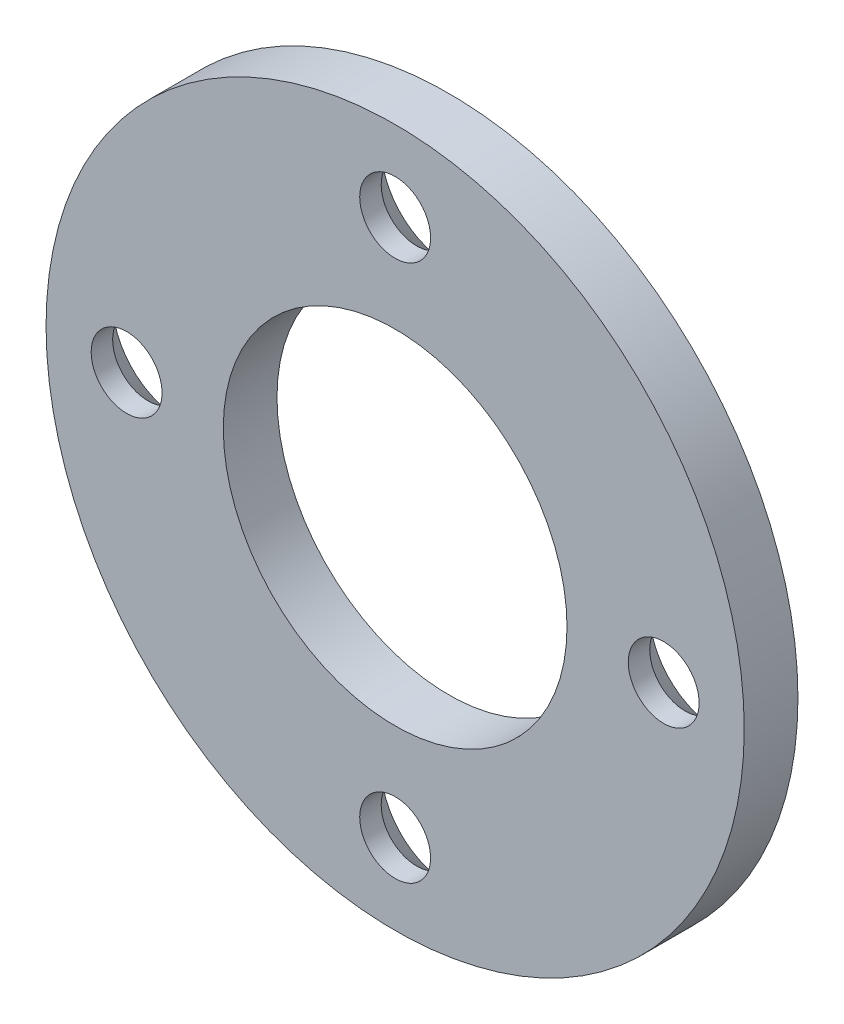
ISO-10303-21;
HEADER;
FILE_DESCRIPTION(('STEP AP214'),'2;1');
FILE_NAME('part.step','',(''),(''),'','','');
FILE_SCHEMA(('AUTOMOTIVE_DESIGN { 1 0 10303 214 1 1 1 1 }'));
ENDSEC;
DATA;
#1=APPLICATION_CONTEXT('core data for automotive mechanical design processes');
#2=APPLICATION_PROTOCOL_DEFINITION('international standard','automotive_design',2000,#1);
#3=PRODUCT_CONTEXT('',#1,'mechanical');
#4=PRODUCT('Part','Part','',(#3));
#5=PRODUCT_RELATED_PRODUCT_CATEGORY('part','',(#4));
#6=PRODUCT_DEFINITION_FORMATION('','',#4);
#7=PRODUCT_DEFINITION_CONTEXT('part definition',#1,'design');
#8=PRODUCT_DEFINITION('design','',#6,#7);
#9=PRODUCT_DEFINITION_SHAPE('','',#8);
#10=(LENGTH_UNIT() NAMED_UNIT(*) SI_UNIT(.MILLI.,.METRE.));
#11=(NAMED_UNIT(*) PLANE_ANGLE_UNIT() SI_UNIT($,.RADIAN.));
#12=(NAMED_UNIT(*) SI_UNIT($,.STERADIAN.) SOLID_ANGLE_UNIT());
#13=UNCERTAINTY_MEASURE_WITH_UNIT(LENGTH_MEASURE(1.E-05),#10,'distance_accuracy_value','');
#14=(GEOMETRIC_REPRESENTATION_CONTEXT(3) GLOBAL_UNCERTAINTY_ASSIGNED_CONTEXT((#13)) GLOBAL_UNIT_ASSIGNED_CONTEXT((#10,
#11,#12)) REPRESENTATION_CONTEXT('',''));
#15=CARTESIAN_POINT('',(0.,0.,0.));
#16=DIRECTION('',(0.,0.,1.));
#17=DIRECTION('',(1.,0.,0.));
#18=AXIS2_PLACEMENT_3D('',#15,#16,#17);
#19=CARTESIAN_POINT('',(0.,0.,5.));
#20=DIRECTION('',(0.,0.,-1.));
#21=DIRECTION('',(-1.,0.,0.));
#22=AXIS2_PLACEMENT_3D('',#19,#20,#21);
#23=CYLINDRICAL_SURFACE('',#22,32.5);
#24=CARTESIAN_POINT('',(0.,0.,5.));
#25=DIRECTION('',(0.,0.,1.));
#26=DIRECTION('',(1.,0.,0.));
#27=AXIS2_PLACEMENT_3D('',#24,#25,#26);
#28=CIRCLE('',#27,32.5);
#29=CARTESIAN_POINT('',(32.5,0.,5.));
#30=VERTEX_POINT('',#29);
#31=EDGE_CURVE('E10',#30,#30,#28,.T.);
#32=ORIENTED_EDGE('',*,*,#31,.F.);
#33=EDGE_LOOP('',(#32));
#34=FACE_BOUND('',#33,.T.);
#35=CARTESIAN_POINT('',(0.,0.,0.));
#36=DIRECTION('',(0.,0.,1.));
#37=DIRECTION('',(1.,0.,0.));
#38=AXIS2_PLACEMENT_3D('',#35,#36,#37);
#39=CIRCLE('',#38,32.5);
#40=CARTESIAN_POINT('',(32.5,0.,0.));
#41=VERTEX_POINT('',#40);
#42=EDGE_CURVE('E35',#41,#41,#39,.T.);
#43=ORIENTED_EDGE('',*,*,#42,.T.);
#44=EDGE_LOOP('',(#43));
#45=FACE_BOUND('',#44,.T.);
#46=ADVANCED_FACE('F32',(#34,#45),#23,.T.);
#47=CARTESIAN_POINT('',(0.,0.,5.));
#48=DIRECTION('',(0.,0.,1.));
#49=DIRECTION('',(1.,0.,0.));
#50=AXIS2_PLACEMENT_3D('',#47,#48,#49);
#51=PLANE('',#50);
#52=CARTESIAN_POINT('',(0.,0.,5.));
#53=DIRECTION('',(0.,0.,1.));
#54=DIRECTION('',(1.,0.,0.));
#55=AXIS2_PLACEMENT_3D('',#52,#53,#54);
#56=CIRCLE('',#55,16.);
#57=CARTESIAN_POINT('',(16.,0.,5.));
#58=VERTEX_POINT('',#57);
#59=EDGE_CURVE('E80',#58,#58,#56,.T.);
#60=ORIENTED_EDGE('',*,*,#59,.F.);
#61=EDGE_LOOP('',(#60));
#62=FACE_BOUND('',#61,.T.);
#63=CARTESIAN_POINT('',(-25.,-2.61861100413235E-13,5.));
#64=DIRECTION('',(0.,0.,-1.));
#65=DIRECTION('',(-1.,0.,0.));
#66=AXIS2_PLACEMENT_3D('',#63,#64,#65);
#67=CIRCLE('',#66,3.3);
#68=CARTESIAN_POINT('',(-28.3,-2.61861100413235E-13,5.));
#69=VERTEX_POINT('',#68);
#70=EDGE_CURVE('E70',#69,#69,#67,.T.);
#71=ORIENTED_EDGE('',*,*,#70,.T.);
#72=EDGE_LOOP('',(#71));
#73=FACE_BOUND('',#72,.T.);
#74=CARTESIAN_POINT('',(0.,25.,5.));
#75=DIRECTION('',(0.,0.,-1.));
#76=DIRECTION('',(-1.,0.,0.));
#77=AXIS2_PLACEMENT_3D('',#74,#75,#76);
#78=CIRCLE('',#77,3.3);
#79=CARTESIAN_POINT('',(-3.3,25.,5.));
#80=VERTEX_POINT('',#79);
#81=EDGE_CURVE('E61',#80,#80,#78,.T.);
#82=ORIENTED_EDGE('',*,*,#81,.T.);
#83=EDGE_LOOP('',(#82));
#84=FACE_BOUND('',#83,.T.);
#85=CARTESIAN_POINT('',(25.,0.,5.));
#86=DIRECTION('',(0.,0.,-1.));
#87=DIRECTION('',(-1.,0.,0.));
#88=AXIS2_PLACEMENT_3D('',#85,#86,#87);
#89=CIRCLE('',#88,3.3);
#90=CARTESIAN_POINT('',(21.7,0.,5.));
#91=VERTEX_POINT('',#90);
#92=EDGE_CURVE('E52',#91,#91,#89,.T.);
#93=ORIENTED_EDGE('',*,*,#92,.T.);
#94=EDGE_LOOP('',(#93));
#95=FACE_BOUND('',#94,.T.);
#96=CARTESIAN_POINT('',(0.,-25.,5.));
#97=DIRECTION('',(0.,0.,-1.));
#98=DIRECTION('',(-1.,0.,0.));
#99=AXIS2_PLACEMENT_3D('',#96,#97,#98);
#100=CIRCLE('',#99,3.3);
#101=CARTESIAN_POINT('',(-3.3,-25.,5.));
#102=VERTEX_POINT('',#101);
#103=EDGE_CURVE('E42',#102,#102,#100,.T.);
#104=ORIENTED_EDGE('',*,*,#103,.T.);
#105=EDGE_LOOP('',(#104));
#106=FACE_BOUND('',#105,.T.);
#107=ORIENTED_EDGE('',*,*,#31,.T.);
#108=EDGE_LOOP('',(#107));
#109=FACE_BOUND('',#108,.T.);
#110=ADVANCED_FACE('F96',(#62,#73,#84,#95,#106,#109),#51,.T.);
#111=CARTESIAN_POINT('',(0.,0.,0.));
#112=DIRECTION('',(0.,0.,1.));
#113=DIRECTION('',(1.,0.,0.));
#114=AXIS2_PLACEMENT_3D('',#111,#112,#113);
#115=PLANE('',#114);
#116=CARTESIAN_POINT('',(0.,0.,0.));
#117=DIRECTION('',(0.,0.,1.));
#118=DIRECTION('',(1.,0.,0.));
#119=AXIS2_PLACEMENT_3D('',#116,#117,#118);
#120=CIRCLE('',#119,16.);
#121=CARTESIAN_POINT('',(16.,0.,0.));
#122=VERTEX_POINT('',#121);
#123=EDGE_CURVE('E79',#122,#122,#120,.T.);
#124=ORIENTED_EDGE('',*,*,#123,.T.);
#125=EDGE_LOOP('',(#124));
#126=FACE_BOUND('',#125,.T.);
#127=CARTESIAN_POINT('',(-25.,-2.61861100413235E-13,0.));
#128=DIRECTION('',(0.,0.,-1.));
#129=DIRECTION('',(-1.,0.,0.));
#130=AXIS2_PLACEMENT_3D('',#127,#128,#129);
#131=CIRCLE('',#130,6.3);
#132=CARTESIAN_POINT('',(-31.3,-2.61861100413235E-13,0.));
#133=VERTEX_POINT('',#132);
#134=EDGE_CURVE('E76',#133,#133,#131,.T.);
#135=ORIENTED_EDGE('',*,*,#134,.F.);
#136=EDGE_LOOP('',(#135));
#137=FACE_BOUND('',#136,.T.);
#138=CARTESIAN_POINT('',(0.,25.,0.));
#139=DIRECTION('',(0.,0.,-1.));
#140=DIRECTION('',(-1.,0.,0.));
#141=AXIS2_PLACEMENT_3D('',#138,#139,#140);
#142=CIRCLE('',#141,6.3);
#143=CARTESIAN_POINT('',(-6.3,25.,0.));
#144=VERTEX_POINT('',#143);
#145=EDGE_CURVE('E67',#144,#144,#142,.T.);
#146=ORIENTED_EDGE('',*,*,#145,.F.);
#147=EDGE_LOOP('',(#146));
#148=FACE_BOUND('',#147,.T.);
#149=CARTESIAN_POINT('',(25.,0.,0.));
#150=DIRECTION('',(0.,0.,-1.));
#151=DIRECTION('',(-1.,0.,0.));
#152=AXIS2_PLACEMENT_3D('',#149,#150,#151);
#153=CIRCLE('',#152,6.3);
#154=CARTESIAN_POINT('',(18.7,0.,0.));
#155=VERTEX_POINT('',#154);
#156=EDGE_CURVE('E58',#155,#155,#153,.T.);
#157=ORIENTED_EDGE('',*,*,#156,.F.);
#158=EDGE_LOOP('',(#157));
#159=FACE_BOUND('',#158,.T.);
#160=CARTESIAN_POINT('',(0.,-25.,0.));
#161=DIRECTION('',(0.,0.,-1.));
#162=DIRECTION('',(-1.,0.,0.));
#163=AXIS2_PLACEMENT_3D('',#160,#161,#162);
#164=CIRCLE('',#163,6.3);
#165=CARTESIAN_POINT('',(-6.3,-25.,0.));
#166=VERTEX_POINT('',#165);
#167=EDGE_CURVE('E49',#166,#166,#164,.T.);
#168=ORIENTED_EDGE('',*,*,#167,.F.);
#169=EDGE_LOOP('',(#168));
#170=FACE_BOUND('',#169,.T.);
#171=ORIENTED_EDGE('',*,*,#42,.F.);
#172=EDGE_LOOP('',(#171));
#173=FACE_BOUND('',#172,.T.);
#174=ADVANCED_FACE('F86',(#126,#137,#148,#159,#170,#173),#115,.F.);
#175=CARTESIAN_POINT('',(0.,-25.,0.));
#176=DIRECTION('',(0.,0.,-1.));
#177=DIRECTION('',(-1.,0.,0.));
#178=AXIS2_PLACEMENT_3D('',#175,#176,#177);
#179=CYLINDRICAL_SURFACE('',#178,3.3);
#180=ORIENTED_EDGE('',*,*,#103,.F.);
#181=EDGE_LOOP('',(#180));
#182=FACE_BOUND('',#181,.T.);
#183=CARTESIAN_POINT('',(0.,-25.,3.));
#184=DIRECTION('',(0.,0.,-1.));
#185=DIRECTION('',(-1.,0.,0.));
#186=AXIS2_PLACEMENT_3D('',#183,#184,#185);
#187=CIRCLE('',#186,3.3);
#188=CARTESIAN_POINT('',(-3.3,-25.,3.));
#189=VERTEX_POINT('',#188);
#190=EDGE_CURVE('E46',#189,#189,#187,.T.);
#191=ORIENTED_EDGE('',*,*,#190,.T.);
#192=EDGE_LOOP('',(#191));
#193=FACE_BOUND('',#192,.T.);
#194=ADVANCED_FACE('F108',(#182,#193),#179,.F.);
#195=CARTESIAN_POINT('',(0.,-25.,0.));
#196=DIRECTION('',(0.,0.,-1.));
#197=DIRECTION('',(-1.,0.,0.));
#198=AXIS2_PLACEMENT_3D('',#195,#196,#197);
#199=CONICAL_SURFACE('',#198,6.3,0.785398163397449);
#200=ORIENTED_EDGE('',*,*,#190,.F.);
#201=EDGE_LOOP('',(#200));
#202=FACE_BOUND('',#201,.T.);
#203=ORIENTED_EDGE('',*,*,#167,.T.);
#204=EDGE_LOOP('',(#203));
#205=FACE_BOUND('',#204,.T.);
#206=ADVANCED_FACE('F111',(#202,#205),#199,.F.);
#207=CARTESIAN_POINT('',(25.,0.,0.));
#208=DIRECTION('',(0.,0.,-1.));
#209=DIRECTION('',(-1.,0.,0.));
#210=AXIS2_PLACEMENT_3D('',#207,#208,#209);
#211=CYLINDRICAL_SURFACE('',#210,3.3);
#212=ORIENTED_EDGE('',*,*,#92,.F.);
#213=EDGE_LOOP('',(#212));
#214=FACE_BOUND('',#213,.T.);
#215=CARTESIAN_POINT('',(25.,0.,3.));
#216=DIRECTION('',(0.,0.,-1.));
#217=DIRECTION('',(-1.,0.,0.));
#218=AXIS2_PLACEMENT_3D('',#215,#216,#217);
#219=CIRCLE('',#218,3.3);
#220=CARTESIAN_POINT('',(21.7,0.,3.));
#221=VERTEX_POINT('',#220);
#222=EDGE_CURVE('E55',#221,#221,#219,.T.);
#223=ORIENTED_EDGE('',*,*,#222,.T.);
#224=EDGE_LOOP('',(#223));
#225=FACE_BOUND('',#224,.T.);
#226=ADVANCED_FACE('F117',(#214,#225),#211,.F.);
#227=CARTESIAN_POINT('',(25.,0.,0.));
#228=DIRECTION('',(0.,0.,-1.));
#229=DIRECTION('',(-1.,0.,0.));
#230=AXIS2_PLACEMENT_3D('',#227,#228,#229);
#231=CONICAL_SURFACE('',#230,6.3,0.785398163397449);
#232=ORIENTED_EDGE('',*,*,#222,.F.);
#233=EDGE_LOOP('',(#232));
#234=FACE_BOUND('',#233,.T.);
#235=ORIENTED_EDGE('',*,*,#156,.T.);
#236=EDGE_LOOP('',(#235));
#237=FACE_BOUND('',#236,.T.);
#238=ADVANCED_FACE('F153',(#234,#237),#231,.F.);
#239=CARTESIAN_POINT('',(0.,25.,0.));
#240=DIRECTION('',(0.,0.,-1.));
#241=DIRECTION('',(-1.,0.,0.));
#242=AXIS2_PLACEMENT_3D('',#239,#240,#241);
#243=CYLINDRICAL_SURFACE('',#242,3.3);
#244=ORIENTED_EDGE('',*,*,#81,.F.);
#245=EDGE_LOOP('',(#244));
#246=FACE_BOUND('',#245,.T.);
#247=CARTESIAN_POINT('',(0.,25.,3.));
#248=DIRECTION('',(0.,0.,-1.));
#249=DIRECTION('',(-1.,0.,0.));
#250=AXIS2_PLACEMENT_3D('',#247,#248,#249);
#251=CIRCLE('',#250,3.3);
#252=CARTESIAN_POINT('',(-3.3,25.,3.));
#253=VERTEX_POINT('',#252);
#254=EDGE_CURVE('E64',#253,#253,#251,.T.);
#255=ORIENTED_EDGE('',*,*,#254,.T.);
#256=EDGE_LOOP('',(#255));
#257=FACE_BOUND('',#256,.T.);
#258=ADVANCED_FACE('F161',(#246,#257),#243,.F.);
#259=CARTESIAN_POINT('',(0.,25.,0.));
#260=DIRECTION('',(0.,0.,-1.));
#261=DIRECTION('',(-1.,0.,0.));
#262=AXIS2_PLACEMENT_3D('',#259,#260,#261);
#263=CONICAL_SURFACE('',#262,6.3,0.785398163397449);
#264=ORIENTED_EDGE('',*,*,#254,.F.);
#265=EDGE_LOOP('',(#264));
#266=FACE_BOUND('',#265,.T.);
#267=ORIENTED_EDGE('',*,*,#145,.T.);
#268=EDGE_LOOP('',(#267));
#269=FACE_BOUND('',#268,.T.);
#270=ADVANCED_FACE('F169',(#266,#269),#263,.F.);
#271=CARTESIAN_POINT('',(-25.,-2.61861100413235E-13,0.));
#272=DIRECTION('',(0.,0.,-1.));
#273=DIRECTION('',(-1.,0.,0.));
#274=AXIS2_PLACEMENT_3D('',#271,#272,#273);
#275=CYLINDRICAL_SURFACE('',#274,3.3);
#276=ORIENTED_EDGE('',*,*,#70,.F.);
#277=EDGE_LOOP('',(#276));
#278=FACE_BOUND('',#277,.T.);
#279=CARTESIAN_POINT('',(-25.,-2.61861100413235E-13,3.));
#280=DIRECTION('',(0.,0.,-1.));
#281=DIRECTION('',(-1.,0.,0.));
#282=AXIS2_PLACEMENT_3D('',#279,#280,#281);
#283=CIRCLE('',#282,3.3);
#284=CARTESIAN_POINT('',(-28.3,-2.61861100413235E-13,3.));
#285=VERTEX_POINT('',#284);
#286=EDGE_CURVE('E73',#285,#285,#283,.T.);
#287=ORIENTED_EDGE('',*,*,#286,.T.);
#288=EDGE_LOOP('',(#287));
#289=FACE_BOUND('',#288,.T.);
#290=ADVANCED_FACE('F177',(#278,#289),#275,.F.);
#291=CARTESIAN_POINT('',(-25.,-2.61861100413235E-13,0.));
#292=DIRECTION('',(0.,0.,-1.));
#293=DIRECTION('',(-1.,0.,0.));
#294=AXIS2_PLACEMENT_3D('',#291,#292,#293);
#295=CONICAL_SURFACE('',#294,6.3,0.785398163397449);
#296=ORIENTED_EDGE('',*,*,#286,.F.);
#297=EDGE_LOOP('',(#296));
#298=FACE_BOUND('',#297,.T.);
#299=ORIENTED_EDGE('',*,*,#134,.T.);
#300=EDGE_LOOP('',(#299));
#301=FACE_BOUND('',#300,.T.);
#302=ADVANCED_FACE('F92',(#298,#301),#295,.F.);
#303=CARTESIAN_POINT('',(0.,0.,0.));
#304=DIRECTION('',(0.,0.,1.));
#305=DIRECTION('',(1.,0.,0.));
#306=AXIS2_PLACEMENT_3D('',#303,#304,#305);
#307=CYLINDRICAL_SURFACE('',#306,16.);
#308=ORIENTED_EDGE('',*,*,#123,.F.);
#309=EDGE_LOOP('',(#308));
#310=FACE_BOUND('',#309,.T.);
#311=ORIENTED_EDGE('',*,*,#59,.T.);
#312=EDGE_LOOP('',(#311));
#313=FACE_BOUND('',#312,.T.);
#314=ADVANCED_FACE('F89',(#310,#313),#307,.F.);
#315=CLOSED_SHELL('',(#46,#110,#174,#194,#206,#226,#238,#258,#270,#290,#302,#314));
#316=MANIFOLD_SOLID_BREP('B2',#315);
#317=ADVANCED_BREP_SHAPE_REPRESENTATION('',(#18,#316),#14);
#318=SHAPE_DEFINITION_REPRESENTATION(#9,#317);
ENDSEC;
END-ISO-10303-21;
